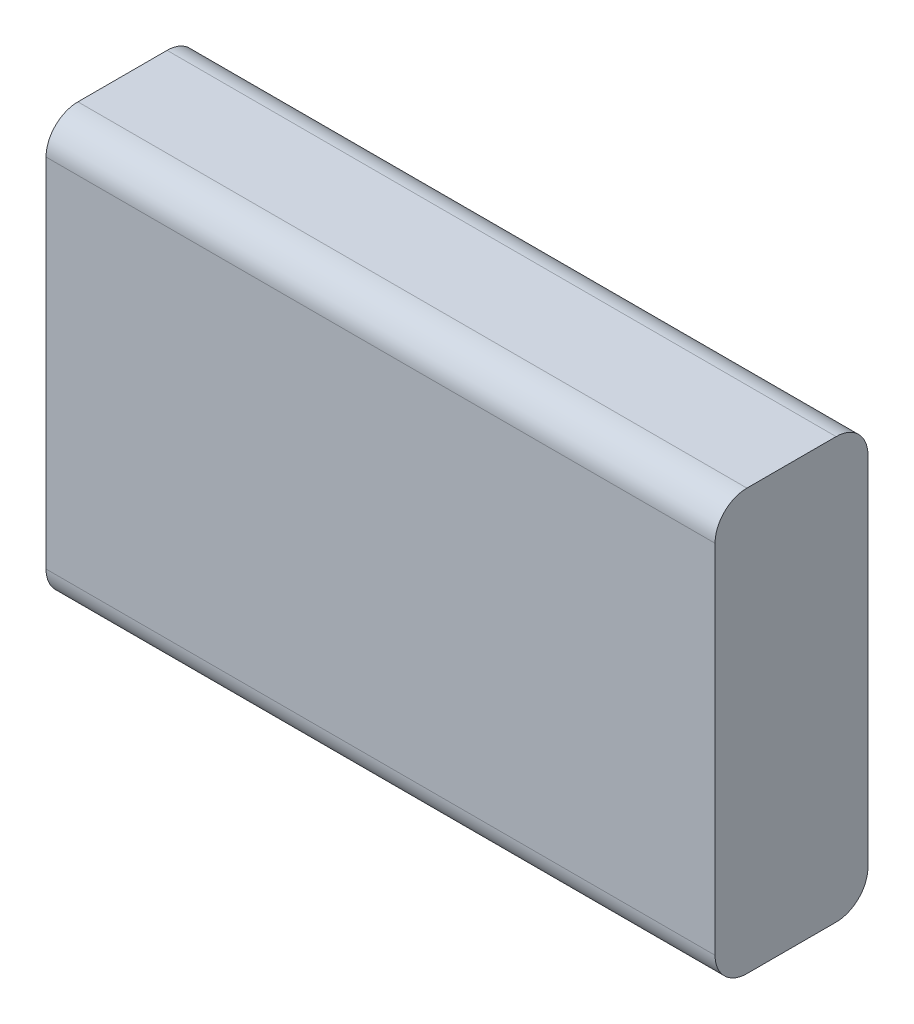
ISO-10303-21;
HEADER;
FILE_DESCRIPTION(('STEP AP214'),'2;1');
FILE_NAME('part.step','',(''),(''),'','','');
FILE_SCHEMA(('AUTOMOTIVE_DESIGN { 1 0 10303 214 1 1 1 1 }'));
ENDSEC;
DATA;
#1=APPLICATION_CONTEXT('core data for automotive mechanical design processes');
#2=APPLICATION_PROTOCOL_DEFINITION('international standard','automotive_design',2000,#1);
#3=PRODUCT_CONTEXT('',#1,'mechanical');
#4=PRODUCT('Part','Part','',(#3));
#5=PRODUCT_RELATED_PRODUCT_CATEGORY('part','',(#4));
#6=PRODUCT_DEFINITION_FORMATION('','',#4);
#7=PRODUCT_DEFINITION_CONTEXT('part definition',#1,'design');
#8=PRODUCT_DEFINITION('design','',#6,#7);
#9=PRODUCT_DEFINITION_SHAPE('','',#8);
#10=(LENGTH_UNIT() NAMED_UNIT(*) SI_UNIT(.MILLI.,.METRE.));
#11=(NAMED_UNIT(*) PLANE_ANGLE_UNIT() SI_UNIT($,.RADIAN.));
#12=(NAMED_UNIT(*) SI_UNIT($,.STERADIAN.) SOLID_ANGLE_UNIT());
#13=UNCERTAINTY_MEASURE_WITH_UNIT(LENGTH_MEASURE(1.E-05),#10,'distance_accuracy_value','');
#14=(GEOMETRIC_REPRESENTATION_CONTEXT(3) GLOBAL_UNCERTAINTY_ASSIGNED_CONTEXT((#13)) GLOBAL_UNIT_ASSIGNED_CONTEXT((#10,
#11,#12)) REPRESENTATION_CONTEXT('',''));
#15=CARTESIAN_POINT('',(0.,0.,0.));
#16=DIRECTION('',(0.,0.,1.));
#17=DIRECTION('',(1.,0.,0.));
#18=AXIS2_PLACEMENT_3D('',#15,#16,#17);
#19=CARTESIAN_POINT('',(-5.08678857270113,64.3241836530651,24.));
#20=DIRECTION('',(1.,0.,0.));
#21=DIRECTION('',(0.,1.,0.));
#22=AXIS2_PLACEMENT_3D('',#19,#20,#21);
#23=PLANE('',#22);
#24=DIRECTION('',(0.,-1.,0.));
#25=VECTOR('',#24,1.);
#26=CARTESIAN_POINT('',(-5.08678857270113,64.3241836530651,0.));
#27=LINE('',#26,#25);
#28=CARTESIAN_POINT('',(-5.08678857270113,59.3241836530651,0.));
#29=VERTEX_POINT('',#28);
#30=CARTESIAN_POINT('',(-5.08678857270112,3.32418365306508,0.));
#31=VERTEX_POINT('',#30);
#32=EDGE_CURVE('E166',#29,#31,#27,.T.);
#33=ORIENTED_EDGE('',*,*,#32,.T.);
#34=CARTESIAN_POINT('',(-5.08678857270112,3.32418365306507,5.));
#35=DIRECTION('',(1.,0.,0.));
#36=DIRECTION('',(0.,1.,0.));
#37=AXIS2_PLACEMENT_3D('',#34,#35,#36);
#38=CIRCLE('',#37,5.);
#39=CARTESIAN_POINT('',(-5.08678857270112,-1.67581634693493,5.));
#40=VERTEX_POINT('',#39);
#41=EDGE_CURVE('E140',#31,#40,#38,.F.);
#42=ORIENTED_EDGE('',*,*,#41,.T.);
#43=DIRECTION('',(0.,0.,-1.));
#44=VECTOR('',#43,1.);
#45=CARTESIAN_POINT('',(-5.08678857270112,-1.67581634693493,24.));
#46=LINE('',#45,#44);
#47=CARTESIAN_POINT('',(-5.08678857270112,-1.67581634693493,19.));
#48=VERTEX_POINT('',#47);
#49=EDGE_CURVE('E119',#48,#40,#46,.T.);
#50=ORIENTED_EDGE('',*,*,#49,.F.);
#51=CARTESIAN_POINT('',(-5.08678857270112,3.32418365306507,19.));
#52=DIRECTION('',(1.,0.,0.));
#53=DIRECTION('',(0.,1.,0.));
#54=AXIS2_PLACEMENT_3D('',#51,#52,#53);
#55=CIRCLE('',#54,5.);
#56=CARTESIAN_POINT('',(-5.08678857270112,3.32418365306508,24.));
#57=VERTEX_POINT('',#56);
#58=EDGE_CURVE('E124',#48,#57,#55,.F.);
#59=ORIENTED_EDGE('',*,*,#58,.T.);
#60=DIRECTION('',(0.,-1.,0.));
#61=VECTOR('',#60,1.);
#62=CARTESIAN_POINT('',(-5.08678857270113,64.3241836530651,24.));
#63=LINE('',#62,#61);
#64=CARTESIAN_POINT('',(-5.08678857270113,59.3241836530651,24.));
#65=VERTEX_POINT('',#64);
#66=EDGE_CURVE('E161',#65,#57,#63,.T.);
#67=ORIENTED_EDGE('',*,*,#66,.F.);
#68=CARTESIAN_POINT('',(-5.08678857270113,59.3241836530651,19.));
#69=DIRECTION('',(1.,0.,0.));
#70=DIRECTION('',(0.,1.,0.));
#71=AXIS2_PLACEMENT_3D('',#68,#69,#70);
#72=CIRCLE('',#71,5.);
#73=CARTESIAN_POINT('',(-5.08678857270113,64.3241836530651,19.));
#74=VERTEX_POINT('',#73);
#75=EDGE_CURVE('E54',#65,#74,#72,.F.);
#76=ORIENTED_EDGE('',*,*,#75,.T.);
#77=DIRECTION('',(0.,0.,-1.));
#78=VECTOR('',#77,1.);
#79=CARTESIAN_POINT('',(-5.08678857270113,64.3241836530651,24.));
#80=LINE('',#79,#78);
#81=CARTESIAN_POINT('',(-5.08678857270113,64.3241836530651,5.));
#82=VERTEX_POINT('',#81);
#83=EDGE_CURVE('E151',#74,#82,#80,.T.);
#84=ORIENTED_EDGE('',*,*,#83,.T.);
#85=CARTESIAN_POINT('',(-5.08678857270113,59.3241836530651,5.));
#86=DIRECTION('',(1.,0.,0.));
#87=DIRECTION('',(0.,1.,0.));
#88=AXIS2_PLACEMENT_3D('',#85,#86,#87);
#89=CIRCLE('',#88,5.);
#90=EDGE_CURVE('E47',#82,#29,#89,.F.);
#91=ORIENTED_EDGE('',*,*,#90,.T.);
#92=EDGE_LOOP('',(#33,#42,#50,#59,#67,#76,#84,#91));
#93=FACE_BOUND('',#92,.T.);
#94=ADVANCED_FACE('F32',(#93),#23,.F.);
#95=CARTESIAN_POINT('',(-5.08678857270112,-1.67581634693493,24.));
#96=DIRECTION('',(0.,1.,0.));
#97=DIRECTION('',(0.,0.,1.));
#98=AXIS2_PLACEMENT_3D('',#95,#96,#97);
#99=PLANE('',#98);
#100=ORIENTED_EDGE('',*,*,#49,.T.);
#101=DIRECTION('',(1.,0.,0.));
#102=VECTOR('',#101,1.);
#103=CARTESIAN_POINT('',(-5.08678857270112,-1.67581634693493,5.));
#104=LINE('',#103,#102);
#105=CARTESIAN_POINT('',(99.9132114272989,-1.67581634693493,5.));
#106=VERTEX_POINT('',#105);
#107=EDGE_CURVE('E118',#40,#106,#104,.T.);
#108=ORIENTED_EDGE('',*,*,#107,.T.);
#109=DIRECTION('',(0.,0.,-1.));
#110=VECTOR('',#109,1.);
#111=CARTESIAN_POINT('',(99.9132114272989,-1.67581634693493,24.));
#112=LINE('',#111,#110);
#113=CARTESIAN_POINT('',(99.9132114272989,-1.67581634693493,19.));
#114=VERTEX_POINT('',#113);
#115=EDGE_CURVE('E101',#114,#106,#112,.T.);
#116=ORIENTED_EDGE('',*,*,#115,.F.);
#117=DIRECTION('',(1.,0.,0.));
#118=VECTOR('',#117,1.);
#119=CARTESIAN_POINT('',(-5.08678857270112,-1.67581634693493,19.));
#120=LINE('',#119,#118);
#121=EDGE_CURVE('E115',#114,#48,#120,.F.);
#122=ORIENTED_EDGE('',*,*,#121,.T.);
#123=EDGE_LOOP('',(#100,#108,#116,#122));
#124=FACE_BOUND('',#123,.T.);
#125=ADVANCED_FACE('F114',(#124),#99,.F.);
#126=CARTESIAN_POINT('',(99.9132114272989,64.3241836530651,24.));
#127=DIRECTION('',(-1.,0.,0.));
#128=DIRECTION('',(0.,-1.,0.));
#129=AXIS2_PLACEMENT_3D('',#126,#127,#128);
#130=PLANE('',#129);
#131=ORIENTED_EDGE('',*,*,#115,.T.);
#132=CARTESIAN_POINT('',(99.9132114272989,3.32418365306507,5.));
#133=DIRECTION('',(-1.,0.,0.));
#134=DIRECTION('',(0.,-1.,0.));
#135=AXIS2_PLACEMENT_3D('',#132,#133,#134);
#136=CIRCLE('',#135,5.);
#137=CARTESIAN_POINT('',(99.9132114272989,3.32418365306508,0.));
#138=VERTEX_POINT('',#137);
#139=EDGE_CURVE('E108',#106,#138,#136,.F.);
#140=ORIENTED_EDGE('',*,*,#139,.T.);
#141=DIRECTION('',(0.,1.,0.));
#142=VECTOR('',#141,1.);
#143=CARTESIAN_POINT('',(99.9132114272989,64.3241836530651,0.));
#144=LINE('',#143,#142);
#145=CARTESIAN_POINT('',(99.9132114272989,59.3241836530651,0.));
#146=VERTEX_POINT('',#145);
#147=EDGE_CURVE('E163',#138,#146,#144,.T.);
#148=ORIENTED_EDGE('',*,*,#147,.T.);
#149=CARTESIAN_POINT('',(99.9132114272989,59.3241836530651,5.));
#150=DIRECTION('',(-1.,0.,0.));
#151=DIRECTION('',(0.,-1.,0.));
#152=AXIS2_PLACEMENT_3D('',#149,#150,#151);
#153=CIRCLE('',#152,5.);
#154=CARTESIAN_POINT('',(99.9132114272989,64.3241836530651,5.));
#155=VERTEX_POINT('',#154);
#156=EDGE_CURVE('E109',#146,#155,#153,.F.);
#157=ORIENTED_EDGE('',*,*,#156,.T.);
#158=DIRECTION('',(0.,0.,-1.));
#159=VECTOR('',#158,1.);
#160=CARTESIAN_POINT('',(99.9132114272989,64.3241836530651,24.));
#161=LINE('',#160,#159);
#162=CARTESIAN_POINT('',(99.9132114272989,64.3241836530651,19.));
#163=VERTEX_POINT('',#162);
#164=EDGE_CURVE('E120',#163,#155,#161,.T.);
#165=ORIENTED_EDGE('',*,*,#164,.F.);
#166=CARTESIAN_POINT('',(99.9132114272989,59.3241836530651,19.));
#167=DIRECTION('',(-1.,0.,0.));
#168=DIRECTION('',(0.,-1.,0.));
#169=AXIS2_PLACEMENT_3D('',#166,#167,#168);
#170=CIRCLE('',#169,5.);
#171=CARTESIAN_POINT('',(99.9132114272989,59.3241836530651,24.));
#172=VERTEX_POINT('',#171);
#173=EDGE_CURVE('E126',#163,#172,#170,.F.);
#174=ORIENTED_EDGE('',*,*,#173,.T.);
#175=DIRECTION('',(0.,1.,0.));
#176=VECTOR('',#175,1.);
#177=CARTESIAN_POINT('',(99.9132114272989,64.3241836530651,24.));
#178=LINE('',#177,#176);
#179=CARTESIAN_POINT('',(99.9132114272989,3.32418365306508,24.));
#180=VERTEX_POINT('',#179);
#181=EDGE_CURVE('E103',#180,#172,#178,.T.);
#182=ORIENTED_EDGE('',*,*,#181,.F.);
#183=CARTESIAN_POINT('',(99.9132114272989,3.32418365306507,19.));
#184=DIRECTION('',(-1.,0.,0.));
#185=DIRECTION('',(0.,-1.,0.));
#186=AXIS2_PLACEMENT_3D('',#183,#184,#185);
#187=CIRCLE('',#186,5.);
#188=EDGE_CURVE('E98',#180,#114,#187,.F.);
#189=ORIENTED_EDGE('',*,*,#188,.T.);
#190=EDGE_LOOP('',(#131,#140,#148,#157,#165,#174,#182,#189));
#191=FACE_BOUND('',#190,.T.);
#192=ADVANCED_FACE('F100',(#191),#130,.F.);
#193=CARTESIAN_POINT('',(-5.08678857270113,64.3241836530651,24.));
#194=DIRECTION('',(0.,-1.,0.));
#195=DIRECTION('',(0.,0.,-1.));
#196=AXIS2_PLACEMENT_3D('',#193,#194,#195);
#197=PLANE('',#196);
#198=ORIENTED_EDGE('',*,*,#164,.T.);
#199=DIRECTION('',(-1.,0.,0.));
#200=VECTOR('',#199,1.);
#201=CARTESIAN_POINT('',(-5.08678857270113,64.3241836530651,5.));
#202=LINE('',#201,#200);
#203=EDGE_CURVE('E11',#155,#82,#202,.T.);
#204=ORIENTED_EDGE('',*,*,#203,.T.);
#205=ORIENTED_EDGE('',*,*,#83,.F.);
#206=DIRECTION('',(-1.,0.,0.));
#207=VECTOR('',#206,1.);
#208=CARTESIAN_POINT('',(99.9132114272989,64.3241836530651,19.));
#209=LINE('',#208,#207);
#210=EDGE_CURVE('E40',#74,#163,#209,.F.);
#211=ORIENTED_EDGE('',*,*,#210,.T.);
#212=EDGE_LOOP('',(#198,#204,#205,#211));
#213=FACE_BOUND('',#212,.T.);
#214=ADVANCED_FACE('F150',(#213),#197,.F.);
#215=CARTESIAN_POINT('',(0.,0.,24.));
#216=DIRECTION('',(0.,0.,1.));
#217=DIRECTION('',(1.,0.,0.));
#218=AXIS2_PLACEMENT_3D('',#215,#216,#217);
#219=PLANE('',#218);
#220=ORIENTED_EDGE('',*,*,#66,.T.);
#221=DIRECTION('',(1.,0.,0.));
#222=VECTOR('',#221,1.);
#223=CARTESIAN_POINT('',(99.9132114272989,3.32418365306507,24.));
#224=LINE('',#223,#222);
#225=EDGE_CURVE('E145',#57,#180,#224,.T.);
#226=ORIENTED_EDGE('',*,*,#225,.T.);
#227=ORIENTED_EDGE('',*,*,#181,.T.);
#228=DIRECTION('',(-1.,0.,0.));
#229=VECTOR('',#228,1.);
#230=CARTESIAN_POINT('',(-5.08678857270113,59.3241836530651,24.));
#231=LINE('',#230,#229);
#232=EDGE_CURVE('E142',#172,#65,#231,.T.);
#233=ORIENTED_EDGE('',*,*,#232,.T.);
#234=EDGE_LOOP('',(#220,#226,#227,#233));
#235=FACE_BOUND('',#234,.T.);
#236=ADVANCED_FACE('F160',(#235),#219,.T.);
#237=CARTESIAN_POINT('',(0.,0.,0.));
#238=DIRECTION('',(0.,0.,1.));
#239=DIRECTION('',(1.,0.,0.));
#240=AXIS2_PLACEMENT_3D('',#237,#238,#239);
#241=PLANE('',#240);
#242=ORIENTED_EDGE('',*,*,#147,.F.);
#243=DIRECTION('',(1.,0.,0.));
#244=VECTOR('',#243,1.);
#245=CARTESIAN_POINT('',(0.,3.32418365306507,0.));
#246=LINE('',#245,#244);
#247=EDGE_CURVE('E135',#138,#31,#246,.F.);
#248=ORIENTED_EDGE('',*,*,#247,.T.);
#249=ORIENTED_EDGE('',*,*,#32,.F.);
#250=DIRECTION('',(-1.,0.,0.));
#251=VECTOR('',#250,1.);
#252=CARTESIAN_POINT('',(0.,59.3241836530651,0.));
#253=LINE('',#252,#251);
#254=EDGE_CURVE('E133',#29,#146,#253,.F.);
#255=ORIENTED_EDGE('',*,*,#254,.T.);
#256=EDGE_LOOP('',(#242,#248,#249,#255));
#257=FACE_BOUND('',#256,.T.);
#258=ADVANCED_FACE('F174',(#257),#241,.F.);
#259=CARTESIAN_POINT('',(-5.08678857270112,3.32418365306507,5.));
#260=DIRECTION('',(1.,0.,0.));
#261=DIRECTION('',(0.,0.,-1.));
#262=AXIS2_PLACEMENT_3D('',#259,#260,#261);
#263=CYLINDRICAL_SURFACE('',#262,5.);
#264=ORIENTED_EDGE('',*,*,#41,.F.);
#265=ORIENTED_EDGE('',*,*,#247,.F.);
#266=ORIENTED_EDGE('',*,*,#139,.F.);
#267=ORIENTED_EDGE('',*,*,#107,.F.);
#268=EDGE_LOOP('',(#264,#265,#266,#267));
#269=FACE_BOUND('',#268,.T.);
#270=ADVANCED_FACE('F182',(#269),#263,.T.);
#271=CARTESIAN_POINT('',(0.,3.32418365306507,19.));
#272=DIRECTION('',(-1.,0.,0.));
#273=DIRECTION('',(0.,0.,1.));
#274=AXIS2_PLACEMENT_3D('',#271,#272,#273);
#275=CYLINDRICAL_SURFACE('',#274,5.);
#276=ORIENTED_EDGE('',*,*,#58,.F.);
#277=ORIENTED_EDGE('',*,*,#121,.F.);
#278=ORIENTED_EDGE('',*,*,#188,.F.);
#279=ORIENTED_EDGE('',*,*,#225,.F.);
#280=EDGE_LOOP('',(#276,#277,#278,#279));
#281=FACE_BOUND('',#280,.T.);
#282=ADVANCED_FACE('F123',(#281),#275,.T.);
#283=CARTESIAN_POINT('',(-5.08678857270113,59.3241836530651,5.));
#284=DIRECTION('',(-1.,0.,0.));
#285=DIRECTION('',(0.,0.,1.));
#286=AXIS2_PLACEMENT_3D('',#283,#284,#285);
#287=CYLINDRICAL_SURFACE('',#286,5.);
#288=ORIENTED_EDGE('',*,*,#156,.F.);
#289=ORIENTED_EDGE('',*,*,#254,.F.);
#290=ORIENTED_EDGE('',*,*,#90,.F.);
#291=ORIENTED_EDGE('',*,*,#203,.F.);
#292=EDGE_LOOP('',(#288,#289,#290,#291));
#293=FACE_BOUND('',#292,.T.);
#294=ADVANCED_FACE('F176',(#293),#287,.T.);
#295=CARTESIAN_POINT('',(0.,59.3241836530651,19.));
#296=DIRECTION('',(1.,0.,0.));
#297=DIRECTION('',(0.,0.,-1.));
#298=AXIS2_PLACEMENT_3D('',#295,#296,#297);
#299=CYLINDRICAL_SURFACE('',#298,5.);
#300=ORIENTED_EDGE('',*,*,#173,.F.);
#301=ORIENTED_EDGE('',*,*,#210,.F.);
#302=ORIENTED_EDGE('',*,*,#75,.F.);
#303=ORIENTED_EDGE('',*,*,#232,.F.);
#304=EDGE_LOOP('',(#300,#301,#302,#303));
#305=FACE_BOUND('',#304,.T.);
#306=ADVANCED_FACE('F34',(#305),#299,.T.);
#307=CLOSED_SHELL('',(#94,#125,#192,#214,#236,#258,#270,#282,#294,#306));
#308=MANIFOLD_SOLID_BREP('B2',#307);
#309=ADVANCED_BREP_SHAPE_REPRESENTATION('',(#18,#308),#14);
#310=SHAPE_DEFINITION_REPRESENTATION(#9,#309);
ENDSEC;
END-ISO-10303-21;
